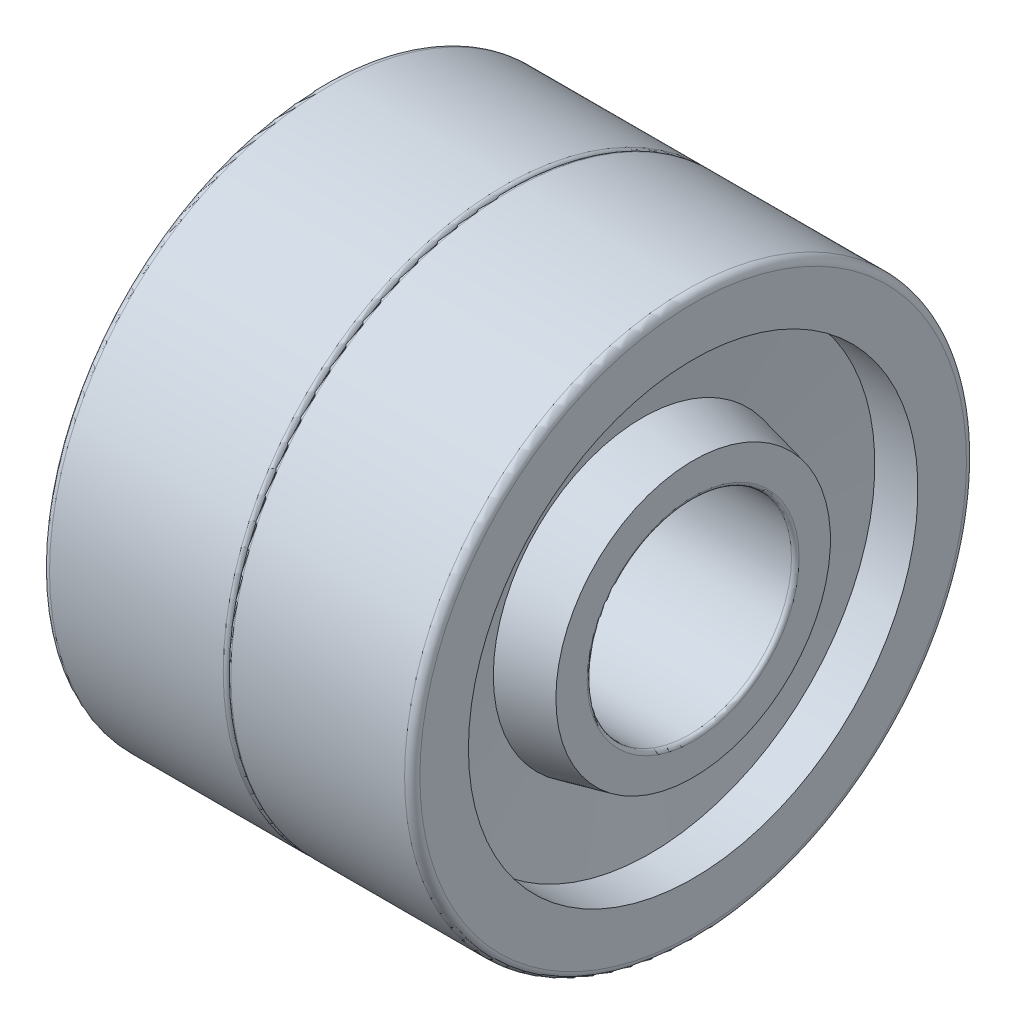
ISO-10303-21;
HEADER;
FILE_DESCRIPTION(('STEP AP214'),'2;1');
FILE_NAME('part.step','',(''),(''),'','','');
FILE_SCHEMA(('AUTOMOTIVE_DESIGN { 1 0 10303 214 1 1 1 1 }'));
ENDSEC;
DATA;
#1=APPLICATION_CONTEXT('core data for automotive mechanical design processes');
#2=APPLICATION_PROTOCOL_DEFINITION('international standard','automotive_design',2000,#1);
#3=PRODUCT_CONTEXT('',#1,'mechanical');
#4=PRODUCT('Part','Part','',(#3));
#5=PRODUCT_RELATED_PRODUCT_CATEGORY('part','',(#4));
#6=PRODUCT_DEFINITION_FORMATION('','',#4);
#7=PRODUCT_DEFINITION_CONTEXT('part definition',#1,'design');
#8=PRODUCT_DEFINITION('design','',#6,#7);
#9=PRODUCT_DEFINITION_SHAPE('','',#8);
#10=(LENGTH_UNIT() NAMED_UNIT(*) SI_UNIT(.MILLI.,.METRE.));
#11=(NAMED_UNIT(*) PLANE_ANGLE_UNIT() SI_UNIT($,.RADIAN.));
#12=(NAMED_UNIT(*) SI_UNIT($,.STERADIAN.) SOLID_ANGLE_UNIT());
#13=UNCERTAINTY_MEASURE_WITH_UNIT(LENGTH_MEASURE(1.E-05),#10,'distance_accuracy_value','');
#14=(GEOMETRIC_REPRESENTATION_CONTEXT(3) GLOBAL_UNCERTAINTY_ASSIGNED_CONTEXT((#13)) GLOBAL_UNIT_ASSIGNED_CONTEXT((#10,
#11,#12)) REPRESENTATION_CONTEXT('',''));
#15=CARTESIAN_POINT('',(0.,0.,0.));
#16=DIRECTION('',(0.,0.,1.));
#17=DIRECTION('',(1.,0.,0.));
#18=AXIS2_PLACEMENT_3D('',#15,#16,#17);
#19=CARTESIAN_POINT('',(7.55,0.,0.));
#20=DIRECTION('',(-1.,0.,0.));
#21=DIRECTION('',(0.,0.,1.));
#22=AXIS2_PLACEMENT_3D('',#19,#20,#21);
#23=CYLINDRICAL_SURFACE('',#22,4.);
#24=CARTESIAN_POINT('',(10.95,0.,0.));
#25=DIRECTION('',(1.,0.,0.));
#26=DIRECTION('',(0.,0.,1.));
#27=AXIS2_PLACEMENT_3D('',#24,#25,#26);
#28=CIRCLE('',#27,4.);
#29=CARTESIAN_POINT('',(10.95,0.,4.));
#30=VERTEX_POINT('',#29);
#31=EDGE_CURVE('E148',#30,#30,#28,.F.);
#32=ORIENTED_EDGE('',*,*,#31,.F.);
#33=EDGE_LOOP('',(#32));
#34=FACE_BOUND('',#33,.T.);
#35=CARTESIAN_POINT('',(4.15,0.,0.));
#36=DIRECTION('',(1.,0.,0.));
#37=DIRECTION('',(0.,0.,1.));
#38=AXIS2_PLACEMENT_3D('',#35,#36,#37);
#39=CIRCLE('',#38,4.);
#40=CARTESIAN_POINT('',(4.15,0.,4.));
#41=VERTEX_POINT('',#40);
#42=EDGE_CURVE('E143',#41,#41,#39,.T.);
#43=ORIENTED_EDGE('',*,*,#42,.F.);
#44=EDGE_LOOP('',(#43));
#45=FACE_BOUND('',#44,.T.);
#46=ADVANCED_FACE('F18',(#34,#45),#23,.F.);
#47=CARTESIAN_POINT('',(10.95,0.,0.));
#48=DIRECTION('',(1.,0.,0.));
#49=DIRECTION('',(0.,0.,1.));
#50=AXIS2_PLACEMENT_3D('',#47,#48,#49);
#51=TOROIDAL_SURFACE('',#50,4.3,0.3);
#52=ORIENTED_EDGE('',*,*,#31,.T.);
#53=EDGE_LOOP('',(#52));
#54=FACE_BOUND('',#53,.T.);
#55=CARTESIAN_POINT('',(11.25,0.,0.));
#56=DIRECTION('',(1.,0.,0.));
#57=DIRECTION('',(0.,0.,1.));
#58=AXIS2_PLACEMENT_3D('',#55,#56,#57);
#59=CIRCLE('',#58,4.30000000833);
#60=CARTESIAN_POINT('',(11.25,0.,4.30000000833));
#61=VERTEX_POINT('',#60);
#62=EDGE_CURVE('E136',#61,#61,#59,.F.);
#63=ORIENTED_EDGE('',*,*,#62,.F.);
#64=EDGE_LOOP('',(#63));
#65=FACE_BOUND('',#64,.T.);
#66=ADVANCED_FACE('F125',(#54,#65),#51,.T.);
#67=CARTESIAN_POINT('',(4.15,0.,0.));
#68=DIRECTION('',(1.,0.,0.));
#69=DIRECTION('',(0.,0.,1.));
#70=AXIS2_PLACEMENT_3D('',#67,#68,#69);
#71=TOROIDAL_SURFACE('',#70,4.15,0.149999999999999);
#72=ORIENTED_EDGE('',*,*,#42,.T.);
#73=EDGE_LOOP('',(#72));
#74=FACE_BOUND('',#73,.T.);
#75=CARTESIAN_POINT('',(4.,0.,0.));
#76=DIRECTION('',(-1.,0.,0.));
#77=DIRECTION('',(0.,0.,-1.));
#78=AXIS2_PLACEMENT_3D('',#75,#76,#77);
#79=CIRCLE('',#78,4.15);
#80=CARTESIAN_POINT('',(4.,-4.15,0.));
#81=VERTEX_POINT('',#80);
#82=CARTESIAN_POINT('',(4.,0.,-4.15));
#83=VERTEX_POINT('',#82);
#84=EDGE_CURVE('E77',#81,#83,#79,.F.);
#85=ORIENTED_EDGE('',*,*,#84,.F.);
#86=CARTESIAN_POINT('',(4.,0.,0.));
#87=DIRECTION('',(-1.,0.,0.));
#88=DIRECTION('',(0.,-1.,0.));
#89=AXIS2_PLACEMENT_3D('',#86,#87,#88);
#90=CIRCLE('',#89,4.15);
#91=CARTESIAN_POINT('',(4.,0.,4.15));
#92=VERTEX_POINT('',#91);
#93=EDGE_CURVE('E74',#92,#81,#90,.F.);
#94=ORIENTED_EDGE('',*,*,#93,.F.);
#95=CARTESIAN_POINT('',(4.,0.,0.));
#96=DIRECTION('',(-1.,0.,0.));
#97=DIRECTION('',(0.,0.,1.));
#98=AXIS2_PLACEMENT_3D('',#95,#96,#97);
#99=CIRCLE('',#98,4.15);
#100=EDGE_CURVE('E71',#83,#92,#99,.F.);
#101=ORIENTED_EDGE('',*,*,#100,.F.);
#102=EDGE_LOOP('',(#85,#94,#101));
#103=FACE_BOUND('',#102,.T.);
#104=ADVANCED_FACE('F76',(#74,#103),#71,.T.);
#105=CARTESIAN_POINT('',(11.55,0.,0.));
#106=DIRECTION('',(1.,0.,0.));
#107=DIRECTION('',(0.,0.,1.));
#108=AXIS2_PLACEMENT_3D('',#105,#106,#107);
#109=TOROIDAL_SURFACE('',#108,4.3,0.3);
#110=ORIENTED_EDGE('',*,*,#62,.T.);
#111=EDGE_LOOP('',(#110));
#112=FACE_BOUND('',#111,.T.);
#113=CARTESIAN_POINT('',(11.55,0.,0.));
#114=DIRECTION('',(-1.,0.,0.));
#115=DIRECTION('',(0.,0.,1.));
#116=AXIS2_PLACEMENT_3D('',#113,#114,#115);
#117=CIRCLE('',#116,4.);
#118=CARTESIAN_POINT('',(11.55,0.,4.));
#119=VERTEX_POINT('',#118);
#120=EDGE_CURVE('E81',#119,#119,#117,.F.);
#121=ORIENTED_EDGE('',*,*,#120,.T.);
#122=EDGE_LOOP('',(#121));
#123=FACE_BOUND('',#122,.T.);
#124=ADVANCED_FACE('F106',(#112,#123),#109,.T.);
#125=CARTESIAN_POINT('',(4.,-4.7625,0.));
#126=DIRECTION('',(-1.,0.,0.));
#127=DIRECTION('',(0.,0.,1.));
#128=AXIS2_PLACEMENT_3D('',#125,#126,#127);
#129=PLANE('',#128);
#130=ORIENTED_EDGE('',*,*,#100,.T.);
#131=ORIENTED_EDGE('',*,*,#93,.T.);
#132=ORIENTED_EDGE('',*,*,#84,.T.);
#133=EDGE_LOOP('',(#130,#131,#132));
#134=FACE_BOUND('',#133,.T.);
#135=CARTESIAN_POINT('',(4.0000000000191,0.,0.));
#136=DIRECTION('',(1.,0.,0.));
#137=DIRECTION('',(0.,0.,-1.));
#138=AXIS2_PLACEMENT_3D('',#135,#136,#137);
#139=CIRCLE('',#138,5.37500000001246);
#140=CARTESIAN_POINT('',(4.0000000000191,0.,-5.37500000001246));
#141=VERTEX_POINT('',#140);
#142=EDGE_CURVE('E120',#141,#141,#139,.T.);
#143=ORIENTED_EDGE('',*,*,#142,.F.);
#144=EDGE_LOOP('',(#143));
#145=FACE_BOUND('',#144,.T.);
#146=ADVANCED_FACE('F85',(#134,#145),#129,.T.);
#147=CARTESIAN_POINT('',(14.95,0.,0.));
#148=DIRECTION('',(-1.,0.,0.));
#149=DIRECTION('',(0.,0.,1.));
#150=AXIS2_PLACEMENT_3D('',#147,#148,#149);
#151=CYLINDRICAL_SURFACE('',#150,4.);
#152=CARTESIAN_POINT('',(18.35,0.,0.));
#153=DIRECTION('',(1.,0.,0.));
#154=DIRECTION('',(0.,0.,1.));
#155=AXIS2_PLACEMENT_3D('',#152,#153,#154);
#156=CIRCLE('',#155,4.);
#157=CARTESIAN_POINT('',(18.35,0.,4.));
#158=VERTEX_POINT('',#157);
#159=EDGE_CURVE('E167',#158,#158,#156,.F.);
#160=ORIENTED_EDGE('',*,*,#159,.F.);
#161=EDGE_LOOP('',(#160));
#162=FACE_BOUND('',#161,.T.);
#163=ORIENTED_EDGE('',*,*,#120,.F.);
#164=EDGE_LOOP('',(#163));
#165=FACE_BOUND('',#164,.T.);
#166=ADVANCED_FACE('F105',(#162,#165),#151,.F.);
#167=CARTESIAN_POINT('',(5.99613980671165,0.,0.));
#168=DIRECTION('',(1.,0.,0.));
#169=DIRECTION('',(0.,0.,-1.));
#170=AXIS2_PLACEMENT_3D('',#167,#168,#169);
#171=CONICAL_SURFACE('',#170,5.82929388704656,0.223774663721963);
#172=CARTESIAN_POINT('',(5.99613980688613,0.,0.));
#173=DIRECTION('',(-1.,0.,0.));
#174=DIRECTION('',(0.,-1.,0.));
#175=AXIS2_PLACEMENT_3D('',#172,#173,#174);
#176=CIRCLE('',#175,5.82929388708443);
#177=CARTESIAN_POINT('',(5.99613980688613,-5.82929388708443,0.));
#178=VERTEX_POINT('',#177);
#179=EDGE_CURVE('E326',#178,#178,#176,.T.);
#180=ORIENTED_EDGE('',*,*,#179,.T.);
#181=EDGE_LOOP('',(#180));
#182=FACE_BOUND('',#181,.T.);
#183=ORIENTED_EDGE('',*,*,#142,.T.);
#184=EDGE_LOOP('',(#183));
#185=FACE_BOUND('',#184,.T.);
#186=ADVANCED_FACE('F311',(#182,#185),#171,.T.);
#187=CARTESIAN_POINT('',(18.35,0.,0.));
#188=DIRECTION('',(1.,0.,0.));
#189=DIRECTION('',(0.,0.,1.));
#190=AXIS2_PLACEMENT_3D('',#187,#188,#189);
#191=TOROIDAL_SURFACE('',#190,4.15,0.150000000000001);
#192=ORIENTED_EDGE('',*,*,#159,.T.);
#193=EDGE_LOOP('',(#192));
#194=FACE_BOUND('',#193,.T.);
#195=CARTESIAN_POINT('',(18.5,0.,0.));
#196=DIRECTION('',(1.,0.,0.));
#197=DIRECTION('',(0.,0.,-1.));
#198=AXIS2_PLACEMENT_3D('',#195,#196,#197);
#199=CIRCLE('',#198,4.15);
#200=CARTESIAN_POINT('',(18.5,0.,4.15));
#201=VERTEX_POINT('',#200);
#202=CARTESIAN_POINT('',(18.5,0.,-4.15));
#203=VERTEX_POINT('',#202);
#204=EDGE_CURVE('E322',#201,#203,#199,.F.);
#205=ORIENTED_EDGE('',*,*,#204,.F.);
#206=CARTESIAN_POINT('',(18.5,0.,0.));
#207=DIRECTION('',(1.,0.,0.));
#208=DIRECTION('',(0.,0.,1.));
#209=AXIS2_PLACEMENT_3D('',#206,#207,#208);
#210=CIRCLE('',#209,4.15);
#211=CARTESIAN_POINT('',(18.5,-4.15,0.));
#212=VERTEX_POINT('',#211);
#213=EDGE_CURVE('E293',#212,#201,#210,.F.);
#214=ORIENTED_EDGE('',*,*,#213,.F.);
#215=CARTESIAN_POINT('',(18.5,0.,0.));
#216=DIRECTION('',(1.,0.,0.));
#217=DIRECTION('',(0.,-1.,0.));
#218=AXIS2_PLACEMENT_3D('',#215,#216,#217);
#219=CIRCLE('',#218,4.15);
#220=EDGE_CURVE('E334',#203,#212,#219,.F.);
#221=ORIENTED_EDGE('',*,*,#220,.F.);
#222=EDGE_LOOP('',(#205,#214,#221));
#223=FACE_BOUND('',#222,.T.);
#224=ADVANCED_FACE('F300',(#194,#223),#191,.T.);
#225=CARTESIAN_POINT('',(5.68736111608885,0.,0.));
#226=DIRECTION('',(-1.,0.,0.));
#227=DIRECTION('',(0.,0.,1.));
#228=AXIS2_PLACEMENT_3D('',#225,#226,#227);
#229=CONICAL_SURFACE('',#228,8.80000000000001,1.46722706042878);
#230=CARTESIAN_POINT('',(5.68736111608885,0.,0.));
#231=DIRECTION('',(-1.,0.,0.));
#232=DIRECTION('',(0.,0.,1.));
#233=AXIS2_PLACEMENT_3D('',#230,#231,#232);
#234=CIRCLE('',#233,8.8);
#235=CARTESIAN_POINT('',(5.68736111608885,0.,8.8));
#236=VERTEX_POINT('',#235);
#237=EDGE_CURVE('E164',#236,#236,#234,.T.);
#238=ORIENTED_EDGE('',*,*,#237,.T.);
#239=EDGE_LOOP('',(#238));
#240=FACE_BOUND('',#239,.T.);
#241=ORIENTED_EDGE('',*,*,#179,.F.);
#242=EDGE_LOOP('',(#241));
#243=FACE_BOUND('',#242,.T.);
#244=ADVANCED_FACE('F310',(#240,#243),#229,.F.);
#245=CARTESIAN_POINT('',(18.5,-4.7625,0.));
#246=DIRECTION('',(1.,0.,0.));
#247=DIRECTION('',(0.,0.,-1.));
#248=AXIS2_PLACEMENT_3D('',#245,#246,#247);
#249=PLANE('',#248);
#250=CARTESIAN_POINT('',(18.5000000000173,0.,0.));
#251=DIRECTION('',(-1.,0.,0.));
#252=DIRECTION('',(0.,0.,1.));
#253=AXIS2_PLACEMENT_3D('',#250,#251,#252);
#254=CIRCLE('',#253,5.37499999999697);
#255=CARTESIAN_POINT('',(18.5000000000173,0.,5.37499999999697));
#256=VERTEX_POINT('',#255);
#257=EDGE_CURVE('E161',#256,#256,#254,.T.);
#258=ORIENTED_EDGE('',*,*,#257,.F.);
#259=EDGE_LOOP('',(#258));
#260=FACE_BOUND('',#259,.T.);
#261=ORIENTED_EDGE('',*,*,#213,.T.);
#262=ORIENTED_EDGE('',*,*,#204,.T.);
#263=ORIENTED_EDGE('',*,*,#220,.T.);
#264=EDGE_LOOP('',(#261,#262,#263));
#265=FACE_BOUND('',#264,.T.);
#266=ADVANCED_FACE('F512',(#260,#265),#249,.T.);
#267=CARTESIAN_POINT('',(4.84368055804443,0.,0.));
#268=DIRECTION('',(-1.,0.,0.));
#269=DIRECTION('',(0.,0.,1.));
#270=AXIS2_PLACEMENT_3D('',#267,#268,#269);
#271=CYLINDRICAL_SURFACE('',#270,8.8);
#272=CARTESIAN_POINT('',(4.,0.,0.));
#273=DIRECTION('',(-1.,0.,0.));
#274=DIRECTION('',(0.,0.,1.));
#275=AXIS2_PLACEMENT_3D('',#272,#273,#274);
#276=CIRCLE('',#275,8.8);
#277=CARTESIAN_POINT('',(4.,0.,8.8));
#278=VERTEX_POINT('',#277);
#279=EDGE_CURVE('E157',#278,#278,#276,.F.);
#280=ORIENTED_EDGE('',*,*,#279,.F.);
#281=EDGE_LOOP('',(#280));
#282=FACE_BOUND('',#281,.T.);
#283=ORIENTED_EDGE('',*,*,#237,.F.);
#284=EDGE_LOOP('',(#283));
#285=FACE_BOUND('',#284,.T.);
#286=ADVANCED_FACE('F502',(#282,#285),#271,.F.);
#287=CARTESIAN_POINT('',(16.503860193211,0.,0.));
#288=DIRECTION('',(-1.,0.,0.));
#289=DIRECTION('',(0.,0.,1.));
#290=AXIS2_PLACEMENT_3D('',#287,#288,#289);
#291=CONICAL_SURFACE('',#290,5.82929388706077,0.223774663723784);
#292=ORIENTED_EDGE('',*,*,#257,.T.);
#293=EDGE_LOOP('',(#292));
#294=FACE_BOUND('',#293,.T.);
#295=CARTESIAN_POINT('',(16.5038601931139,0.,0.));
#296=DIRECTION('',(1.,0.,0.));
#297=DIRECTION('',(0.,-1.,0.));
#298=AXIS2_PLACEMENT_3D('',#295,#296,#297);
#299=CIRCLE('',#298,5.82929388708444);
#300=CARTESIAN_POINT('',(16.5038601931139,-5.82929388708444,0.));
#301=VERTEX_POINT('',#300);
#302=EDGE_CURVE('E160',#301,#301,#299,.T.);
#303=ORIENTED_EDGE('',*,*,#302,.T.);
#304=EDGE_LOOP('',(#303));
#305=FACE_BOUND('',#304,.T.);
#306=ADVANCED_FACE('F493',(#294,#305),#291,.T.);
#307=CARTESIAN_POINT('',(4.,-9.75,0.));
#308=DIRECTION('',(-1.,0.,0.));
#309=DIRECTION('',(0.,0.,1.));
#310=AXIS2_PLACEMENT_3D('',#307,#308,#309);
#311=PLANE('',#310);
#312=ORIENTED_EDGE('',*,*,#279,.T.);
#313=EDGE_LOOP('',(#312));
#314=FACE_BOUND('',#313,.T.);
#315=CARTESIAN_POINT('',(4.,0.,0.));
#316=DIRECTION('',(1.,0.,0.));
#317=DIRECTION('',(0.,0.,1.));
#318=AXIS2_PLACEMENT_3D('',#315,#316,#317);
#319=CIRCLE('',#318,10.7);
#320=CARTESIAN_POINT('',(4.,0.,10.7));
#321=VERTEX_POINT('',#320);
#322=CARTESIAN_POINT('',(4.,-10.7,0.));
#323=VERTEX_POINT('',#322);
#324=EDGE_CURVE('E745',#321,#323,#319,.T.);
#325=ORIENTED_EDGE('',*,*,#324,.F.);
#326=CARTESIAN_POINT('',(4.,0.,0.));
#327=DIRECTION('',(1.,0.,0.));
#328=DIRECTION('',(0.,0.,-1.));
#329=AXIS2_PLACEMENT_3D('',#326,#327,#328);
#330=CIRCLE('',#329,10.7);
#331=CARTESIAN_POINT('',(4.,0.,-10.7));
#332=VERTEX_POINT('',#331);
#333=EDGE_CURVE('E737',#332,#321,#330,.T.);
#334=ORIENTED_EDGE('',*,*,#333,.F.);
#335=CARTESIAN_POINT('',(4.,0.,0.));
#336=DIRECTION('',(1.,0.,0.));
#337=DIRECTION('',(0.,-1.,0.));
#338=AXIS2_PLACEMENT_3D('',#335,#336,#337);
#339=CIRCLE('',#338,10.7);
#340=EDGE_CURVE('E280',#323,#332,#339,.T.);
#341=ORIENTED_EDGE('',*,*,#340,.F.);
#342=EDGE_LOOP('',(#325,#334,#341));
#343=FACE_BOUND('',#342,.T.);
#344=ADVANCED_FACE('F484',(#314,#343),#311,.T.);
#345=CARTESIAN_POINT('',(16.8126388839111,0.,0.));
#346=DIRECTION('',(1.,0.,0.));
#347=DIRECTION('',(0.,0.,-1.));
#348=AXIS2_PLACEMENT_3D('',#345,#346,#347);
#349=CONICAL_SURFACE('',#348,8.80000000000001,1.46722706042878);
#350=ORIENTED_EDGE('',*,*,#302,.F.);
#351=EDGE_LOOP('',(#350));
#352=FACE_BOUND('',#351,.T.);
#353=CARTESIAN_POINT('',(16.8126388839111,0.,0.));
#354=DIRECTION('',(-1.,0.,0.));
#355=DIRECTION('',(0.,0.,1.));
#356=AXIS2_PLACEMENT_3D('',#353,#354,#355);
#357=CIRCLE('',#356,8.8);
#358=CARTESIAN_POINT('',(16.8126388839111,0.,8.8));
#359=VERTEX_POINT('',#358);
#360=EDGE_CURVE('E248',#359,#359,#357,.F.);
#361=ORIENTED_EDGE('',*,*,#360,.T.);
#362=EDGE_LOOP('',(#361));
#363=FACE_BOUND('',#362,.T.);
#364=ADVANCED_FACE('F256',(#352,#363),#349,.F.);
#365=CARTESIAN_POINT('',(4.3,0.,0.));
#366=DIRECTION('',(1.,0.,0.));
#367=DIRECTION('',(0.,0.,1.));
#368=AXIS2_PLACEMENT_3D('',#365,#366,#367);
#369=TOROIDAL_SURFACE('',#368,10.7,0.300000000000001);
#370=CARTESIAN_POINT('',(4.3,0.,0.));
#371=DIRECTION('',(-1.,0.,0.));
#372=DIRECTION('',(0.,0.,1.));
#373=AXIS2_PLACEMENT_3D('',#370,#371,#372);
#374=CIRCLE('',#373,11.);
#375=CARTESIAN_POINT('',(4.3,0.,11.));
#376=VERTEX_POINT('',#375);
#377=EDGE_CURVE('E156',#376,#376,#374,.F.);
#378=ORIENTED_EDGE('',*,*,#377,.F.);
#379=EDGE_LOOP('',(#378));
#380=FACE_BOUND('',#379,.T.);
#381=ORIENTED_EDGE('',*,*,#333,.T.);
#382=ORIENTED_EDGE('',*,*,#324,.T.);
#383=ORIENTED_EDGE('',*,*,#340,.T.);
#384=EDGE_LOOP('',(#381,#382,#383));
#385=FACE_BOUND('',#384,.T.);
#386=ADVANCED_FACE('F251',(#380,#385),#369,.T.);
#387=CARTESIAN_POINT('',(17.6563194419556,0.,0.));
#388=DIRECTION('',(-1.,0.,0.));
#389=DIRECTION('',(0.,0.,1.));
#390=AXIS2_PLACEMENT_3D('',#387,#388,#389);
#391=CYLINDRICAL_SURFACE('',#390,8.8);
#392=ORIENTED_EDGE('',*,*,#360,.F.);
#393=EDGE_LOOP('',(#392));
#394=FACE_BOUND('',#393,.T.);
#395=CARTESIAN_POINT('',(18.5,0.,0.));
#396=DIRECTION('',(-1.,0.,0.));
#397=DIRECTION('',(0.,0.,1.));
#398=AXIS2_PLACEMENT_3D('',#395,#396,#397);
#399=CIRCLE('',#398,8.8);
#400=CARTESIAN_POINT('',(18.5,0.,8.8));
#401=VERTEX_POINT('',#400);
#402=EDGE_CURVE('E152',#401,#401,#399,.T.);
#403=ORIENTED_EDGE('',*,*,#402,.F.);
#404=EDGE_LOOP('',(#403));
#405=FACE_BOUND('',#404,.T.);
#406=ADVANCED_FACE('F255',(#394,#405),#391,.F.);
#407=CARTESIAN_POINT('',(7.7,0.,0.));
#408=DIRECTION('',(-1.,0.,0.));
#409=DIRECTION('',(0.,0.,1.));
#410=AXIS2_PLACEMENT_3D('',#407,#408,#409);
#411=CYLINDRICAL_SURFACE('',#410,11.);
#412=ORIENTED_EDGE('',*,*,#377,.T.);
#413=EDGE_LOOP('',(#412));
#414=FACE_BOUND('',#413,.T.);
#415=CARTESIAN_POINT('',(11.1,0.,0.));
#416=DIRECTION('',(1.,0.,0.));
#417=DIRECTION('',(0.,0.,1.));
#418=AXIS2_PLACEMENT_3D('',#415,#416,#417);
#419=CIRCLE('',#418,11.);
#420=CARTESIAN_POINT('',(11.1,0.,11.));
#421=VERTEX_POINT('',#420);
#422=EDGE_CURVE('E155',#421,#421,#419,.T.);
#423=ORIENTED_EDGE('',*,*,#422,.F.);
#424=EDGE_LOOP('',(#423));
#425=FACE_BOUND('',#424,.T.);
#426=ADVANCED_FACE('F215',(#414,#425),#411,.T.);
#427=CARTESIAN_POINT('',(18.5,-9.75,0.));
#428=DIRECTION('',(1.,0.,0.));
#429=DIRECTION('',(0.,0.,-1.));
#430=AXIS2_PLACEMENT_3D('',#427,#428,#429);
#431=PLANE('',#430);
#432=CARTESIAN_POINT('',(18.5,0.,0.));
#433=DIRECTION('',(-1.,0.,0.));
#434=DIRECTION('',(0.,0.,1.));
#435=AXIS2_PLACEMENT_3D('',#432,#433,#434);
#436=CIRCLE('',#435,10.7);
#437=CARTESIAN_POINT('',(18.5,0.,10.7));
#438=VERTEX_POINT('',#437);
#439=CARTESIAN_POINT('',(18.5,0.,-10.7));
#440=VERTEX_POINT('',#439);
#441=EDGE_CURVE('E233',#438,#440,#436,.T.);
#442=ORIENTED_EDGE('',*,*,#441,.F.);
#443=CARTESIAN_POINT('',(18.5,0.,0.));
#444=DIRECTION('',(-1.,0.,0.));
#445=DIRECTION('',(0.,-1.,0.));
#446=AXIS2_PLACEMENT_3D('',#443,#444,#445);
#447=CIRCLE('',#446,10.7);
#448=CARTESIAN_POINT('',(18.5,-10.7,0.));
#449=VERTEX_POINT('',#448);
#450=EDGE_CURVE('E231',#449,#438,#447,.T.);
#451=ORIENTED_EDGE('',*,*,#450,.F.);
#452=CARTESIAN_POINT('',(18.5,0.,0.));
#453=DIRECTION('',(-1.,0.,0.));
#454=DIRECTION('',(0.,0.,-1.));
#455=AXIS2_PLACEMENT_3D('',#452,#453,#454);
#456=CIRCLE('',#455,10.7);
#457=EDGE_CURVE('E38',#440,#449,#456,.T.);
#458=ORIENTED_EDGE('',*,*,#457,.F.);
#459=EDGE_LOOP('',(#442,#451,#458));
#460=FACE_BOUND('',#459,.T.);
#461=ORIENTED_EDGE('',*,*,#402,.T.);
#462=EDGE_LOOP('',(#461));
#463=FACE_BOUND('',#462,.T.);
#464=ADVANCED_FACE('F206',(#460,#463),#431,.T.);
#465=CARTESIAN_POINT('',(11.1,0.,0.));
#466=DIRECTION('',(1.,0.,0.));
#467=DIRECTION('',(0.,0.,1.));
#468=AXIS2_PLACEMENT_3D('',#465,#466,#467);
#469=TOROIDAL_SURFACE('',#468,10.85,0.149999999999999);
#470=ORIENTED_EDGE('',*,*,#422,.T.);
#471=EDGE_LOOP('',(#470));
#472=FACE_BOUND('',#471,.T.);
#473=CARTESIAN_POINT('',(11.25,0.,0.));
#474=DIRECTION('',(1.,0.,0.));
#475=DIRECTION('',(0.,0.,1.));
#476=AXIS2_PLACEMENT_3D('',#473,#474,#475);
#477=CIRCLE('',#476,10.85);
#478=CARTESIAN_POINT('',(11.25,0.,10.85));
#479=VERTEX_POINT('',#478);
#480=EDGE_CURVE('E197',#479,#479,#477,.T.);
#481=ORIENTED_EDGE('',*,*,#480,.F.);
#482=EDGE_LOOP('',(#481));
#483=FACE_BOUND('',#482,.T.);
#484=ADVANCED_FACE('F187',(#472,#483),#469,.T.);
#485=CARTESIAN_POINT('',(18.2,0.,0.));
#486=DIRECTION('',(1.,0.,0.));
#487=DIRECTION('',(0.,0.,1.));
#488=AXIS2_PLACEMENT_3D('',#485,#486,#487);
#489=TOROIDAL_SURFACE('',#488,10.7,0.300000000000001);
#490=ORIENTED_EDGE('',*,*,#450,.T.);
#491=ORIENTED_EDGE('',*,*,#441,.T.);
#492=ORIENTED_EDGE('',*,*,#457,.T.);
#493=EDGE_LOOP('',(#490,#491,#492));
#494=FACE_BOUND('',#493,.T.);
#495=CARTESIAN_POINT('',(18.2,0.,0.));
#496=DIRECTION('',(-1.,0.,0.));
#497=DIRECTION('',(0.,0.,1.));
#498=AXIS2_PLACEMENT_3D('',#495,#496,#497);
#499=CIRCLE('',#498,11.);
#500=CARTESIAN_POINT('',(18.2,0.,11.));
#501=VERTEX_POINT('',#500);
#502=EDGE_CURVE('E29',#501,#501,#499,.T.);
#503=ORIENTED_EDGE('',*,*,#502,.F.);
#504=EDGE_LOOP('',(#503));
#505=FACE_BOUND('',#504,.T.);
#506=ADVANCED_FACE('F175',(#494,#505),#489,.T.);
#507=CARTESIAN_POINT('',(11.4,0.,0.));
#508=DIRECTION('',(1.,0.,0.));
#509=DIRECTION('',(0.,0.,1.));
#510=AXIS2_PLACEMENT_3D('',#507,#508,#509);
#511=TOROIDAL_SURFACE('',#510,10.85,0.149999999999999);
#512=ORIENTED_EDGE('',*,*,#480,.T.);
#513=EDGE_LOOP('',(#512));
#514=FACE_BOUND('',#513,.T.);
#515=CARTESIAN_POINT('',(11.4,0.,0.));
#516=DIRECTION('',(-1.,0.,0.));
#517=DIRECTION('',(0.,0.,1.));
#518=AXIS2_PLACEMENT_3D('',#515,#516,#517);
#519=CIRCLE('',#518,11.);
#520=CARTESIAN_POINT('',(11.4,0.,11.));
#521=VERTEX_POINT('',#520);
#522=EDGE_CURVE('E11',#521,#521,#519,.F.);
#523=ORIENTED_EDGE('',*,*,#522,.F.);
#524=EDGE_LOOP('',(#523));
#525=FACE_BOUND('',#524,.T.);
#526=ADVANCED_FACE('F186',(#514,#525),#511,.T.);
#527=CARTESIAN_POINT('',(14.8,0.,0.));
#528=DIRECTION('',(-1.,0.,0.));
#529=DIRECTION('',(0.,0.,1.));
#530=AXIS2_PLACEMENT_3D('',#527,#528,#529);
#531=CYLINDRICAL_SURFACE('',#530,11.);
#532=ORIENTED_EDGE('',*,*,#502,.T.);
#533=EDGE_LOOP('',(#532));
#534=FACE_BOUND('',#533,.T.);
#535=ORIENTED_EDGE('',*,*,#522,.T.);
#536=EDGE_LOOP('',(#535));
#537=FACE_BOUND('',#536,.T.);
#538=ADVANCED_FACE('F347',(#534,#537),#531,.T.);
#539=CLOSED_SHELL('',(#46,#66,#104,#124,#146,#166,#186,#224,#244,#266,#286,#306,#344,#364,#386,
#406,#426,#464,#484,#506,#526,#538));
#540=CARTESIAN_POINT('',(13.2461398068861,0.,0.));
#541=DIRECTION('',(1.,0.,0.));
#542=DIRECTION('',(0.,0.,-1.));
#543=AXIS2_PLACEMENT_3D('',#540,#541,#542);
#544=CONICAL_SURFACE('',#543,9.17070611291557,1.46722706042878);
#545=CARTESIAN_POINT('',(13.2461398068861,0.,0.));
#546=DIRECTION('',(-1.,0.,0.));
#547=DIRECTION('',(0.,-1.,0.));
#548=AXIS2_PLACEMENT_3D('',#545,#546,#547);
#549=CIRCLE('',#548,9.17070611291559);
#550=CARTESIAN_POINT('',(13.2461398068861,-9.17070611291559,0.));
#551=VERTEX_POINT('',#550);
#552=EDGE_CURVE('E392',#551,#551,#549,.T.);
#553=ORIENTED_EDGE('',*,*,#552,.T.);
#554=EDGE_LOOP('',(#553));
#555=FACE_BOUND('',#554,.T.);
#556=CARTESIAN_POINT('',(12.9373611160889,0.,0.));
#557=DIRECTION('',(-1.,0.,0.));
#558=DIRECTION('',(0.,0.,1.));
#559=AXIS2_PLACEMENT_3D('',#556,#557,#558);
#560=CIRCLE('',#559,6.2);
#561=CARTESIAN_POINT('',(12.9373611160889,0.,6.2));
#562=VERTEX_POINT('',#561);
#563=EDGE_CURVE('E387',#562,#562,#560,.T.);
#564=ORIENTED_EDGE('',*,*,#563,.F.);
#565=EDGE_LOOP('',(#564));
#566=FACE_BOUND('',#565,.T.);
#567=ADVANCED_FACE('F355',(#555,#566),#544,.T.);
#568=CARTESIAN_POINT('',(11.25,0.,0.));
#569=DIRECTION('',(-1.,0.,0.));
#570=DIRECTION('',(0.,0.,1.));
#571=AXIS2_PLACEMENT_3D('',#568,#569,#570);
#572=CONICAL_SURFACE('',#571,9.62500000000002,0.223774663724952);
#573=CARTESIAN_POINT('',(11.25,0.,0.));
#574=DIRECTION('',(1.,0.,0.));
#575=DIRECTION('',(0.,-1.,0.));
#576=AXIS2_PLACEMENT_3D('',#573,#574,#575);
#577=CIRCLE('',#576,9.62500000000001);
#578=CARTESIAN_POINT('',(11.25,-9.62500000000001,0.));
#579=VERTEX_POINT('',#578);
#580=EDGE_CURVE('E383',#579,#579,#577,.F.);
#581=ORIENTED_EDGE('',*,*,#580,.T.);
#582=EDGE_LOOP('',(#581));
#583=FACE_BOUND('',#582,.T.);
#584=ORIENTED_EDGE('',*,*,#552,.F.);
#585=EDGE_LOOP('',(#584));
#586=FACE_BOUND('',#585,.T.);
#587=ADVANCED_FACE('F357',(#583,#586),#572,.F.);
#588=CARTESIAN_POINT('',(11.25,0.,0.));
#589=DIRECTION('',(-1.,0.,0.));
#590=DIRECTION('',(0.,0.,1.));
#591=AXIS2_PLACEMENT_3D('',#588,#589,#590);
#592=CYLINDRICAL_SURFACE('',#591,6.2);
#593=ORIENTED_EDGE('',*,*,#563,.T.);
#594=EDGE_LOOP('',(#593));
#595=FACE_BOUND('',#594,.T.);
#596=CARTESIAN_POINT('',(9.56263888391115,0.,0.));
#597=DIRECTION('',(-1.,0.,0.));
#598=DIRECTION('',(0.,-1.,0.));
#599=AXIS2_PLACEMENT_3D('',#596,#597,#598);
#600=CIRCLE('',#599,6.2);
#601=CARTESIAN_POINT('',(9.56263888391115,-6.2,0.));
#602=VERTEX_POINT('',#601);
#603=EDGE_CURVE('E151',#602,#602,#600,.T.);
#604=ORIENTED_EDGE('',*,*,#603,.F.);
#605=EDGE_LOOP('',(#604));
#606=FACE_BOUND('',#605,.T.);
#607=ADVANCED_FACE('F362',(#595,#606),#592,.T.);
#608=CARTESIAN_POINT('',(11.25,0.,0.));
#609=DIRECTION('',(1.,0.,0.));
#610=DIRECTION('',(0.,0.,-1.));
#611=AXIS2_PLACEMENT_3D('',#608,#609,#610);
#612=CONICAL_SURFACE('',#611,9.62500000000001,0.223774663724951);
#613=CARTESIAN_POINT('',(9.25386019311387,0.,0.));
#614=DIRECTION('',(-1.,0.,0.));
#615=DIRECTION('',(0.,-1.,0.));
#616=AXIS2_PLACEMENT_3D('',#613,#614,#615);
#617=CIRCLE('',#616,9.17070611291557);
#618=CARTESIAN_POINT('',(9.25386019311387,-9.17070611291557,0.));
#619=VERTEX_POINT('',#618);
#620=EDGE_CURVE('E382',#619,#619,#617,.F.);
#621=ORIENTED_EDGE('',*,*,#620,.F.);
#622=EDGE_LOOP('',(#621));
#623=FACE_BOUND('',#622,.T.);
#624=ORIENTED_EDGE('',*,*,#580,.F.);
#625=EDGE_LOOP('',(#624));
#626=FACE_BOUND('',#625,.T.);
#627=ADVANCED_FACE('F366',(#623,#626),#612,.F.);
#628=CARTESIAN_POINT('',(9.25386019311387,0.,0.));
#629=DIRECTION('',(-1.,0.,0.));
#630=DIRECTION('',(0.,0.,1.));
#631=AXIS2_PLACEMENT_3D('',#628,#629,#630);
#632=CONICAL_SURFACE('',#631,9.17070611291557,1.46722706042878);
#633=ORIENTED_EDGE('',*,*,#603,.T.);
#634=EDGE_LOOP('',(#633));
#635=FACE_BOUND('',#634,.T.);
#636=ORIENTED_EDGE('',*,*,#620,.T.);
#637=EDGE_LOOP('',(#636));
#638=FACE_BOUND('',#637,.T.);
#639=ADVANCED_FACE('F370',(#635,#638),#632,.T.);
#640=CLOSED_SHELL('',(#567,#587,#607,#627,#639));
#641=ORIENTED_CLOSED_SHELL('',*,#640,.T.);
#642=BREP_WITH_VOIDS('B1',#539,(#641));
#643=ADVANCED_BREP_SHAPE_REPRESENTATION('',(#18,#642),#14);
#644=SHAPE_DEFINITION_REPRESENTATION(#9,#643);
ENDSEC;
END-ISO-10303-21;
